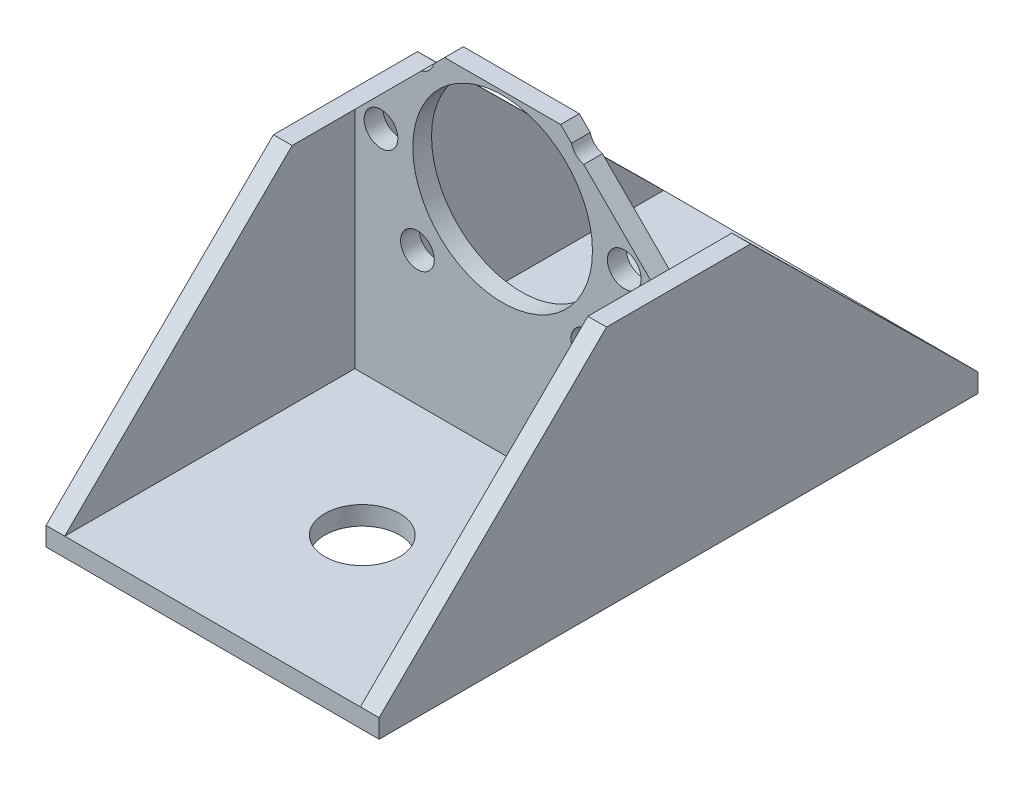
ISO-10303-21;
HEADER;
FILE_DESCRIPTION(('STEP AP214'),'2;1');
FILE_NAME('part.step','',(''),(''),'','','');
FILE_SCHEMA(('AUTOMOTIVE_DESIGN { 1 0 10303 214 1 1 1 1 }'));
ENDSEC;
DATA;
#1=APPLICATION_CONTEXT('core data for automotive mechanical design processes');
#2=APPLICATION_PROTOCOL_DEFINITION('international standard','automotive_design',2000,#1);
#3=PRODUCT_CONTEXT('',#1,'mechanical');
#4=PRODUCT('Part','Part','',(#3));
#5=PRODUCT_RELATED_PRODUCT_CATEGORY('part','',(#4));
#6=PRODUCT_DEFINITION_FORMATION('','',#4);
#7=PRODUCT_DEFINITION_CONTEXT('part definition',#1,'design');
#8=PRODUCT_DEFINITION('design','',#6,#7);
#9=PRODUCT_DEFINITION_SHAPE('','',#8);
#10=(LENGTH_UNIT() NAMED_UNIT(*) SI_UNIT(.MILLI.,.METRE.));
#11=(NAMED_UNIT(*) PLANE_ANGLE_UNIT() SI_UNIT($,.RADIAN.));
#12=(NAMED_UNIT(*) SI_UNIT($,.STERADIAN.) SOLID_ANGLE_UNIT());
#13=UNCERTAINTY_MEASURE_WITH_UNIT(LENGTH_MEASURE(1.E-05),#10,'distance_accuracy_value','');
#14=(GEOMETRIC_REPRESENTATION_CONTEXT(3) GLOBAL_UNCERTAINTY_ASSIGNED_CONTEXT((#13)) GLOBAL_UNIT_ASSIGNED_CONTEXT((#10,
#11,#12)) REPRESENTATION_CONTEXT('',''));
#15=CARTESIAN_POINT('',(0.,0.,0.));
#16=DIRECTION('',(0.,0.,1.));
#17=DIRECTION('',(1.,0.,0.));
#18=AXIS2_PLACEMENT_3D('',#15,#16,#17);
#19=CARTESIAN_POINT('',(14.9999999999999,15.,-1.25));
#20=DIRECTION('',(-0.707106781186544,-0.707106781186551,0.));
#21=DIRECTION('',(0.707106781186551,-0.707106781186544,0.));
#22=AXIS2_PLACEMENT_3D('',#19,#20,#21);
#23=PLANE('',#22);
#24=DIRECTION('',(0.707106781186551,-0.707106781186544,0.));
#25=VECTOR('',#24,1.);
#26=CARTESIAN_POINT('',(14.9999999999999,15.,-1.25));
#27=LINE('',#26,#25);
#28=CARTESIAN_POINT('',(10.8323559285244,19.1676440714755,-1.25));
#29=VERTEX_POINT('',#28);
#30=CARTESIAN_POINT('',(19.75,10.25,-1.25));
#31=VERTEX_POINT('',#30);
#32=EDGE_CURVE('E208',#29,#31,#27,.T.);
#33=ORIENTED_EDGE('',*,*,#32,.F.);
#34=DIRECTION('',(0.,0.,1.));
#35=VECTOR('',#34,1.);
#36=CARTESIAN_POINT('',(10.8323559285244,19.1676440714755,-7.61396103067893));
#37=LINE('',#36,#35);
#38=CARTESIAN_POINT('',(10.8323559285244,19.1676440714755,1.25));
#39=VERTEX_POINT('',#38);
#40=EDGE_CURVE('E337',#29,#39,#37,.T.);
#41=ORIENTED_EDGE('',*,*,#40,.T.);
#42=DIRECTION('',(0.707106781186551,-0.707106781186544,0.));
#43=VECTOR('',#42,1.);
#44=CARTESIAN_POINT('',(14.9999999999999,15.,1.25));
#45=LINE('',#44,#43);
#46=CARTESIAN_POINT('',(19.75,10.25,1.25));
#47=VERTEX_POINT('',#46);
#48=EDGE_CURVE('E339',#39,#47,#45,.T.);
#49=ORIENTED_EDGE('',*,*,#48,.T.);
#50=DIRECTION('',(0.,0.,1.));
#51=VECTOR('',#50,1.);
#52=CARTESIAN_POINT('',(19.75,10.25,-1.25));
#53=LINE('',#52,#51);
#54=EDGE_CURVE('E214',#31,#47,#53,.T.);
#55=ORIENTED_EDGE('',*,*,#54,.F.);
#56=EDGE_LOOP('',(#33,#41,#49,#55));
#57=FACE_BOUND('',#56,.T.);
#58=ADVANCED_FACE('F38',(#57),#23,.F.);
#59=CARTESIAN_POINT('',(-14.9999999999999,15.,-1.25));
#60=DIRECTION('',(-0.707106781186544,0.707106781186551,0.));
#61=DIRECTION('',(-0.707106781186551,-0.707106781186544,0.));
#62=AXIS2_PLACEMENT_3D('',#59,#60,#61);
#63=PLANE('',#62);
#64=DIRECTION('',(0.,0.,1.));
#65=VECTOR('',#64,1.);
#66=CARTESIAN_POINT('',(-10.8323559285243,19.1676440714756,-7.61396103067893));
#67=LINE('',#66,#65);
#68=CARTESIAN_POINT('',(-10.8323559285243,19.1676440714756,-1.25));
#69=VERTEX_POINT('',#68);
#70=CARTESIAN_POINT('',(-10.8323559285243,19.1676440714756,1.25));
#71=VERTEX_POINT('',#70);
#72=EDGE_CURVE('E61',#69,#71,#67,.T.);
#73=ORIENTED_EDGE('',*,*,#72,.F.);
#74=DIRECTION('',(-0.707106781186551,-0.707106781186544,0.));
#75=VECTOR('',#74,1.);
#76=CARTESIAN_POINT('',(-14.9999999999999,15.,-1.25));
#77=LINE('',#76,#75);
#78=CARTESIAN_POINT('',(-19.75,10.25,-1.25));
#79=VERTEX_POINT('',#78);
#80=EDGE_CURVE('E191',#69,#79,#77,.T.);
#81=ORIENTED_EDGE('',*,*,#80,.T.);
#82=DIRECTION('',(0.,0.,1.));
#83=VECTOR('',#82,1.);
#84=CARTESIAN_POINT('',(-19.75,10.25,-1.25));
#85=LINE('',#84,#83);
#86=CARTESIAN_POINT('',(-19.75,10.25,1.25));
#87=VERTEX_POINT('',#86);
#88=EDGE_CURVE('E217',#79,#87,#85,.T.);
#89=ORIENTED_EDGE('',*,*,#88,.T.);
#90=DIRECTION('',(-0.707106781186551,-0.707106781186544,0.));
#91=VECTOR('',#90,1.);
#92=CARTESIAN_POINT('',(-14.9999999999999,15.,1.25));
#93=LINE('',#92,#91);
#94=EDGE_CURVE('E390',#71,#87,#93,.T.);
#95=ORIENTED_EDGE('',*,*,#94,.F.);
#96=EDGE_LOOP('',(#73,#81,#89,#95));
#97=FACE_BOUND('',#96,.T.);
#98=ADVANCED_FACE('F401',(#97),#63,.T.);
#99=CARTESIAN_POINT('',(-19.75,-19.75,-40.));
#100=DIRECTION('',(-1.,0.,0.));
#101=DIRECTION('',(0.,0.,1.));
#102=AXIS2_PLACEMENT_3D('',#99,#100,#101);
#103=PLANE('',#102);
#104=DIRECTION('',(0.,1.,0.));
#105=VECTOR('',#104,1.);
#106=CARTESIAN_POINT('',(-19.75,0.,-1.25));
#107=LINE('',#106,#105);
#108=CARTESIAN_POINT('',(-19.75,-19.75,-1.25));
#109=VERTEX_POINT('',#108);
#110=EDGE_CURVE('E196',#109,#79,#107,.T.);
#111=ORIENTED_EDGE('',*,*,#110,.F.);
#112=DIRECTION('',(0.,0.,1.));
#113=VECTOR('',#112,1.);
#114=CARTESIAN_POINT('',(-19.75,-19.75,-40.));
#115=LINE('',#114,#113);
#116=CARTESIAN_POINT('',(-19.75,-19.75,-40.));
#117=VERTEX_POINT('',#116);
#118=EDGE_CURVE('E287',#117,#109,#115,.T.);
#119=ORIENTED_EDGE('',*,*,#118,.F.);
#120=DIRECTION('',(0.,0.702645672149301,0.711539921163849));
#121=VECTOR('',#120,1.);
#122=CARTESIAN_POINT('',(-19.75,-19.75,-40.));
#123=LINE('',#122,#121);
#124=CARTESIAN_POINT('',(-19.75,10.25,-9.62025316455697));
#125=VERTEX_POINT('',#124);
#126=EDGE_CURVE('E260',#117,#125,#123,.T.);
#127=ORIENTED_EDGE('',*,*,#126,.T.);
#128=DIRECTION('',(0.,0.,1.));
#129=VECTOR('',#128,1.);
#130=CARTESIAN_POINT('',(-19.75,10.25,-40.));
#131=LINE('',#130,#129);
#132=EDGE_CURVE('E264',#125,#79,#131,.T.);
#133=ORIENTED_EDGE('',*,*,#132,.T.);
#134=EDGE_LOOP('',(#111,#119,#127,#133));
#135=FACE_BOUND('',#134,.T.);
#136=ADVANCED_FACE('F406',(#135),#103,.F.);
#137=CARTESIAN_POINT('',(19.75,-19.75,-40.));
#138=DIRECTION('',(1.,0.,0.));
#139=DIRECTION('',(0.,1.,0.));
#140=AXIS2_PLACEMENT_3D('',#137,#138,#139);
#141=PLANE('',#140);
#142=DIRECTION('',(0.,-1.,0.));
#143=VECTOR('',#142,1.);
#144=CARTESIAN_POINT('',(19.75,0.,-1.25));
#145=LINE('',#144,#143);
#146=CARTESIAN_POINT('',(19.75,-19.75,-1.25));
#147=VERTEX_POINT('',#146);
#148=EDGE_CURVE('E205',#31,#147,#145,.T.);
#149=ORIENTED_EDGE('',*,*,#148,.F.);
#150=DIRECTION('',(0.,0.,-1.));
#151=VECTOR('',#150,1.);
#152=CARTESIAN_POINT('',(19.75,10.25,-40.));
#153=LINE('',#152,#151);
#154=CARTESIAN_POINT('',(19.75,10.25,-9.62025316455697));
#155=VERTEX_POINT('',#154);
#156=EDGE_CURVE('E46',#31,#155,#153,.T.);
#157=ORIENTED_EDGE('',*,*,#156,.T.);
#158=DIRECTION('',(0.,-0.702645672149301,-0.711539921163849));
#159=VECTOR('',#158,1.);
#160=CARTESIAN_POINT('',(19.75,-19.75,-40.));
#161=LINE('',#160,#159);
#162=CARTESIAN_POINT('',(19.75,-19.75,-40.));
#163=VERTEX_POINT('',#162);
#164=EDGE_CURVE('E257',#155,#163,#161,.T.);
#165=ORIENTED_EDGE('',*,*,#164,.T.);
#166=DIRECTION('',(0.,0.,1.));
#167=VECTOR('',#166,1.);
#168=CARTESIAN_POINT('',(19.75,-19.75,-40.));
#169=LINE('',#168,#167);
#170=EDGE_CURVE('E282',#163,#147,#169,.T.);
#171=ORIENTED_EDGE('',*,*,#170,.T.);
#172=EDGE_LOOP('',(#149,#157,#165,#171));
#173=FACE_BOUND('',#172,.T.);
#174=ADVANCED_FACE('F309',(#173),#141,.F.);
#175=CARTESIAN_POINT('',(-19.75,-19.75,-40.));
#176=DIRECTION('',(0.,-1.,0.));
#177=DIRECTION('',(0.,0.,-1.));
#178=AXIS2_PLACEMENT_3D('',#175,#176,#177);
#179=PLANE('',#178);
#180=CARTESIAN_POINT('',(0.,-19.75,-20.));
#181=DIRECTION('',(0.,-1.,0.));
#182=DIRECTION('',(0.,0.,-1.));
#183=AXIS2_PLACEMENT_3D('',#180,#181,#182);
#184=CIRCLE('',#183,5.);
#185=CARTESIAN_POINT('',(0.,-19.75,-25.));
#186=VERTEX_POINT('',#185);
#187=EDGE_CURVE('E381',#186,#186,#184,.F.);
#188=ORIENTED_EDGE('',*,*,#187,.F.);
#189=EDGE_LOOP('',(#188));
#190=FACE_BOUND('',#189,.T.);
#191=DIRECTION('',(1.,0.,0.));
#192=VECTOR('',#191,1.);
#193=CARTESIAN_POINT('',(0.,-19.75,-1.25));
#194=LINE('',#193,#192);
#195=EDGE_CURVE('E198',#109,#147,#194,.T.);
#196=ORIENTED_EDGE('',*,*,#195,.T.);
#197=ORIENTED_EDGE('',*,*,#170,.F.);
#198=DIRECTION('',(1.,0.,0.));
#199=VECTOR('',#198,1.);
#200=CARTESIAN_POINT('',(-19.75,-19.75,-40.));
#201=LINE('',#200,#199);
#202=EDGE_CURVE('E278',#117,#163,#201,.T.);
#203=ORIENTED_EDGE('',*,*,#202,.F.);
#204=ORIENTED_EDGE('',*,*,#118,.T.);
#205=EDGE_LOOP('',(#196,#197,#203,#204));
#206=FACE_BOUND('',#205,.T.);
#207=ADVANCED_FACE('F330',(#190,#206),#179,.F.);
#208=CARTESIAN_POINT('',(0.,0.,40.));
#209=DIRECTION('',(0.,0.,-1.));
#210=DIRECTION('',(-1.,0.,0.));
#211=AXIS2_PLACEMENT_3D('',#208,#209,#210);
#212=PLANE('',#211);
#213=DIRECTION('',(1.,0.,0.));
#214=VECTOR('',#213,1.);
#215=CARTESIAN_POINT('',(-112.604855984612,-19.75,40.));
#216=LINE('',#215,#214);
#217=CARTESIAN_POINT('',(-22.25,-19.75,40.));
#218=VERTEX_POINT('',#217);
#219=CARTESIAN_POINT('',(-19.75,-19.75,40.));
#220=VERTEX_POINT('',#219);
#221=EDGE_CURVE('E242',#218,#220,#216,.T.);
#222=ORIENTED_EDGE('',*,*,#221,.F.);
#223=DIRECTION('',(0.,-1.,0.));
#224=VECTOR('',#223,1.);
#225=CARTESIAN_POINT('',(-22.25,-22.25,40.));
#226=LINE('',#225,#224);
#227=CARTESIAN_POINT('',(-22.25,-22.25,40.));
#228=VERTEX_POINT('',#227);
#229=EDGE_CURVE('E273',#218,#228,#226,.T.);
#230=ORIENTED_EDGE('',*,*,#229,.T.);
#231=DIRECTION('',(1.,0.,0.));
#232=VECTOR('',#231,1.);
#233=CARTESIAN_POINT('',(-22.25,-22.25,40.));
#234=LINE('',#233,#232);
#235=CARTESIAN_POINT('',(22.25,-22.25,40.));
#236=VERTEX_POINT('',#235);
#237=EDGE_CURVE('E275',#228,#236,#234,.T.);
#238=ORIENTED_EDGE('',*,*,#237,.T.);
#239=DIRECTION('',(0.,1.,0.));
#240=VECTOR('',#239,1.);
#241=CARTESIAN_POINT('',(22.25,-22.25,40.));
#242=LINE('',#241,#240);
#243=CARTESIAN_POINT('',(22.25,-19.75,40.));
#244=VERTEX_POINT('',#243);
#245=EDGE_CURVE('E270',#236,#244,#242,.T.);
#246=ORIENTED_EDGE('',*,*,#245,.T.);
#247=DIRECTION('',(1.,0.,0.));
#248=VECTOR('',#247,1.);
#249=CARTESIAN_POINT('',(0.,-19.75,40.));
#250=LINE('',#249,#248);
#251=CARTESIAN_POINT('',(19.75,-19.75,40.));
#252=VERTEX_POINT('',#251);
#253=EDGE_CURVE('E300',#252,#244,#250,.T.);
#254=ORIENTED_EDGE('',*,*,#253,.F.);
#255=DIRECTION('',(1.,0.,0.));
#256=VECTOR('',#255,1.);
#257=CARTESIAN_POINT('',(-19.75,-19.75,40.));
#258=LINE('',#257,#256);
#259=EDGE_CURVE('E267',#220,#252,#258,.T.);
#260=ORIENTED_EDGE('',*,*,#259,.F.);
#261=EDGE_LOOP('',(#222,#230,#238,#246,#254,#260));
#262=FACE_BOUND('',#261,.T.);
#263=ADVANCED_FACE('F419',(#262),#212,.F.);
#264=CARTESIAN_POINT('',(22.25,-22.25,-40.));
#265=DIRECTION('',(1.,0.,0.));
#266=DIRECTION('',(0.,0.,-1.));
#267=AXIS2_PLACEMENT_3D('',#264,#265,#266);
#268=PLANE('',#267);
#269=DIRECTION('',(0.,-0.702645672149301,-0.711539921163849));
#270=VECTOR('',#269,1.);
#271=CARTESIAN_POINT('',(22.25,9.99920892334467,-9.87421881180287));
#272=LINE('',#271,#270);
#273=CARTESIAN_POINT('',(22.25,10.25,-9.62025316455697));
#274=VERTEX_POINT('',#273);
#275=CARTESIAN_POINT('',(22.25,-19.75,-40.));
#276=VERTEX_POINT('',#275);
#277=EDGE_CURVE('E226',#274,#276,#272,.T.);
#278=ORIENTED_EDGE('',*,*,#277,.F.);
#279=DIRECTION('',(0.,0.,-1.));
#280=VECTOR('',#279,1.);
#281=CARTESIAN_POINT('',(22.25,10.25,0.));
#282=LINE('',#281,#280);
#283=CARTESIAN_POINT('',(22.25,10.25,9.62025316455697));
#284=VERTEX_POINT('',#283);
#285=EDGE_CURVE('E229',#284,#274,#282,.T.);
#286=ORIENTED_EDGE('',*,*,#285,.F.);
#287=DIRECTION('',(0.,-0.702645672149301,0.711539921163849));
#288=VECTOR('',#287,1.);
#289=CARTESIAN_POINT('',(22.25,9.99920892334467,9.87421881180287));
#290=LINE('',#289,#288);
#291=EDGE_CURVE('E221',#284,#244,#290,.T.);
#292=ORIENTED_EDGE('',*,*,#291,.T.);
#293=ORIENTED_EDGE('',*,*,#245,.F.);
#294=DIRECTION('',(0.,0.,1.));
#295=VECTOR('',#294,1.);
#296=CARTESIAN_POINT('',(22.25,-22.25,-40.));
#297=LINE('',#296,#295);
#298=CARTESIAN_POINT('',(22.25,-22.25,-40.));
#299=VERTEX_POINT('',#298);
#300=EDGE_CURVE('E298',#299,#236,#297,.T.);
#301=ORIENTED_EDGE('',*,*,#300,.F.);
#302=DIRECTION('',(0.,1.,0.));
#303=VECTOR('',#302,1.);
#304=CARTESIAN_POINT('',(22.25,-22.25,-40.));
#305=LINE('',#304,#303);
#306=EDGE_CURVE('E285',#299,#276,#305,.T.);
#307=ORIENTED_EDGE('',*,*,#306,.T.);
#308=EDGE_LOOP('',(#278,#286,#292,#293,#301,#307));
#309=FACE_BOUND('',#308,.T.);
#310=ADVANCED_FACE('F40',(#309),#268,.T.);
#311=CARTESIAN_POINT('',(-22.25,-22.25,-40.));
#312=DIRECTION('',(0.,-1.,0.));
#313=DIRECTION('',(0.,0.,-1.));
#314=AXIS2_PLACEMENT_3D('',#311,#312,#313);
#315=PLANE('',#314);
#316=CARTESIAN_POINT('',(0.,-22.25,-20.));
#317=DIRECTION('',(0.,-1.,0.));
#318=DIRECTION('',(0.,0.,-1.));
#319=AXIS2_PLACEMENT_3D('',#316,#317,#318);
#320=CIRCLE('',#319,5.);
#321=CARTESIAN_POINT('',(0.,-22.25,-25.));
#322=VERTEX_POINT('',#321);
#323=EDGE_CURVE('E378',#322,#322,#320,.T.);
#324=ORIENTED_EDGE('',*,*,#323,.F.);
#325=EDGE_LOOP('',(#324));
#326=FACE_BOUND('',#325,.T.);
#327=CARTESIAN_POINT('',(0.,-22.25,20.));
#328=DIRECTION('',(0.,-1.,0.));
#329=DIRECTION('',(0.,0.,-1.));
#330=AXIS2_PLACEMENT_3D('',#327,#328,#329);
#331=CIRCLE('',#330,5.);
#332=CARTESIAN_POINT('',(0.,-22.25,15.));
#333=VERTEX_POINT('',#332);
#334=EDGE_CURVE('E377',#333,#333,#331,.T.);
#335=ORIENTED_EDGE('',*,*,#334,.F.);
#336=EDGE_LOOP('',(#335));
#337=FACE_BOUND('',#336,.T.);
#338=ORIENTED_EDGE('',*,*,#300,.T.);
#339=ORIENTED_EDGE('',*,*,#237,.F.);
#340=DIRECTION('',(0.,0.,1.));
#341=VECTOR('',#340,1.);
#342=CARTESIAN_POINT('',(-22.25,-22.25,-40.));
#343=LINE('',#342,#341);
#344=CARTESIAN_POINT('',(-22.25,-22.25,-40.));
#345=VERTEX_POINT('',#344);
#346=EDGE_CURVE('E297',#345,#228,#343,.T.);
#347=ORIENTED_EDGE('',*,*,#346,.F.);
#348=DIRECTION('',(1.,0.,0.));
#349=VECTOR('',#348,1.);
#350=CARTESIAN_POINT('',(-22.25,-22.25,-40.));
#351=LINE('',#350,#349);
#352=EDGE_CURVE('E294',#345,#299,#351,.T.);
#353=ORIENTED_EDGE('',*,*,#352,.T.);
#354=EDGE_LOOP('',(#338,#339,#347,#353));
#355=FACE_BOUND('',#354,.T.);
#356=ADVANCED_FACE('F427',(#326,#337,#355),#315,.T.);
#357=CARTESIAN_POINT('',(-22.25,-22.25,-40.));
#358=DIRECTION('',(-1.,0.,0.));
#359=DIRECTION('',(0.,0.,1.));
#360=AXIS2_PLACEMENT_3D('',#357,#358,#359);
#361=PLANE('',#360);
#362=DIRECTION('',(0.,-0.702645672149301,-0.711539921163849));
#363=VECTOR('',#362,1.);
#364=CARTESIAN_POINT('',(-22.25,9.99920892334467,-9.87421881180287));
#365=LINE('',#364,#363);
#366=CARTESIAN_POINT('',(-22.25,10.25,-9.62025316455697));
#367=VERTEX_POINT('',#366);
#368=CARTESIAN_POINT('',(-22.25,-19.75,-40.));
#369=VERTEX_POINT('',#368);
#370=EDGE_CURVE('E228',#367,#369,#365,.T.);
#371=ORIENTED_EDGE('',*,*,#370,.T.);
#372=DIRECTION('',(0.,-1.,0.));
#373=VECTOR('',#372,1.);
#374=CARTESIAN_POINT('',(-22.25,-22.25,-40.));
#375=LINE('',#374,#373);
#376=EDGE_CURVE('E292',#369,#345,#375,.T.);
#377=ORIENTED_EDGE('',*,*,#376,.T.);
#378=ORIENTED_EDGE('',*,*,#346,.T.);
#379=ORIENTED_EDGE('',*,*,#229,.F.);
#380=DIRECTION('',(0.,-0.702645672149301,0.711539921163849));
#381=VECTOR('',#380,1.);
#382=CARTESIAN_POINT('',(-22.25,9.99920892334467,9.87421881180287));
#383=LINE('',#382,#381);
#384=CARTESIAN_POINT('',(-22.25,10.25,9.62025316455697));
#385=VERTEX_POINT('',#384);
#386=EDGE_CURVE('E213',#385,#218,#383,.T.);
#387=ORIENTED_EDGE('',*,*,#386,.F.);
#388=DIRECTION('',(0.,0.,-1.));
#389=VECTOR('',#388,1.);
#390=CARTESIAN_POINT('',(-22.25,10.25,0.));
#391=LINE('',#390,#389);
#392=EDGE_CURVE('E224',#385,#367,#391,.T.);
#393=ORIENTED_EDGE('',*,*,#392,.T.);
#394=EDGE_LOOP('',(#371,#377,#378,#379,#387,#393));
#395=FACE_BOUND('',#394,.T.);
#396=ADVANCED_FACE('F412',(#395),#361,.T.);
#397=CARTESIAN_POINT('',(0.,0.,-40.));
#398=DIRECTION('',(0.,0.,-1.));
#399=DIRECTION('',(-1.,0.,0.));
#400=AXIS2_PLACEMENT_3D('',#397,#398,#399);
#401=PLANE('',#400);
#402=DIRECTION('',(1.,0.,0.));
#403=VECTOR('',#402,1.);
#404=CARTESIAN_POINT('',(-112.604855984612,-19.75,-40.));
#405=LINE('',#404,#403);
#406=EDGE_CURVE('E234',#163,#276,#405,.T.);
#407=ORIENTED_EDGE('',*,*,#406,.T.);
#408=ORIENTED_EDGE('',*,*,#306,.F.);
#409=ORIENTED_EDGE('',*,*,#352,.F.);
#410=ORIENTED_EDGE('',*,*,#376,.F.);
#411=EDGE_CURVE('E245',#369,#117,#405,.T.);
#412=ORIENTED_EDGE('',*,*,#411,.T.);
#413=ORIENTED_EDGE('',*,*,#202,.T.);
#414=EDGE_LOOP('',(#407,#408,#409,#410,#412,#413));
#415=FACE_BOUND('',#414,.T.);
#416=ADVANCED_FACE('F324',(#415),#401,.T.);
#417=CARTESIAN_POINT('',(-19.75,-19.75,1.25));
#418=VERTEX_POINT('',#417);
#419=EDGE_CURVE('E281',#418,#220,#115,.T.);
#420=ORIENTED_EDGE('',*,*,#419,.F.);
#421=DIRECTION('',(0.,1.,0.));
#422=VECTOR('',#421,1.);
#423=CARTESIAN_POINT('',(-19.75,0.,1.25));
#424=LINE('',#423,#422);
#425=EDGE_CURVE('E354',#418,#87,#424,.T.);
#426=ORIENTED_EDGE('',*,*,#425,.T.);
#427=CARTESIAN_POINT('',(-19.75,10.25,9.62025316455697));
#428=VERTEX_POINT('',#427);
#429=EDGE_CURVE('E263',#87,#428,#131,.T.);
#430=ORIENTED_EDGE('',*,*,#429,.T.);
#431=DIRECTION('',(0.,0.702645672149301,-0.711539921163849));
#432=VECTOR('',#431,1.);
#433=CARTESIAN_POINT('',(-19.75,20.2468356933787,-0.503124752788547));
#434=LINE('',#433,#432);
#435=EDGE_CURVE('E254',#220,#428,#434,.T.);
#436=ORIENTED_EDGE('',*,*,#435,.F.);
#437=EDGE_LOOP('',(#420,#426,#430,#436));
#438=FACE_BOUND('',#437,.T.);
#439=ADVANCED_FACE('F395',(#438),#103,.F.);
#440=CARTESIAN_POINT('',(19.75,10.25,9.62025316455697));
#441=VERTEX_POINT('',#440);
#442=EDGE_CURVE('E11',#441,#47,#153,.T.);
#443=ORIENTED_EDGE('',*,*,#442,.T.);
#444=DIRECTION('',(0.,-1.,0.));
#445=VECTOR('',#444,1.);
#446=CARTESIAN_POINT('',(19.75,0.,1.25));
#447=LINE('',#446,#445);
#448=CARTESIAN_POINT('',(19.75,-19.75,1.25));
#449=VERTEX_POINT('',#448);
#450=EDGE_CURVE('E344',#47,#449,#447,.T.);
#451=ORIENTED_EDGE('',*,*,#450,.T.);
#452=EDGE_CURVE('E286',#449,#252,#169,.T.);
#453=ORIENTED_EDGE('',*,*,#452,.T.);
#454=DIRECTION('',(0.,-0.702645672149301,0.711539921163849));
#455=VECTOR('',#454,1.);
#456=CARTESIAN_POINT('',(19.75,20.2468356933787,-0.503124752788547));
#457=LINE('',#456,#455);
#458=EDGE_CURVE('E251',#441,#252,#457,.T.);
#459=ORIENTED_EDGE('',*,*,#458,.F.);
#460=EDGE_LOOP('',(#443,#451,#453,#459));
#461=FACE_BOUND('',#460,.T.);
#462=ADVANCED_FACE('F343',(#461),#141,.F.);
#463=CARTESIAN_POINT('',(0.,-19.75,20.));
#464=DIRECTION('',(0.,-1.,0.));
#465=DIRECTION('',(0.,0.,-1.));
#466=AXIS2_PLACEMENT_3D('',#463,#464,#465);
#467=CIRCLE('',#466,5.);
#468=CARTESIAN_POINT('',(0.,-19.75,15.));
#469=VERTEX_POINT('',#468);
#470=EDGE_CURVE('E382',#469,#469,#467,.F.);
#471=ORIENTED_EDGE('',*,*,#470,.F.);
#472=EDGE_LOOP('',(#471));
#473=FACE_BOUND('',#472,.T.);
#474=ORIENTED_EDGE('',*,*,#452,.F.);
#475=DIRECTION('',(1.,0.,0.));
#476=VECTOR('',#475,1.);
#477=CARTESIAN_POINT('',(0.,-19.75,1.25));
#478=LINE('',#477,#476);
#479=EDGE_CURVE('E351',#418,#449,#478,.T.);
#480=ORIENTED_EDGE('',*,*,#479,.F.);
#481=ORIENTED_EDGE('',*,*,#419,.T.);
#482=ORIENTED_EDGE('',*,*,#259,.T.);
#483=EDGE_LOOP('',(#474,#480,#481,#482));
#484=FACE_BOUND('',#483,.T.);
#485=ADVANCED_FACE('F421',(#473,#484),#179,.F.);
#486=CARTESIAN_POINT('',(-112.604855984612,9.99920892334467,9.87421881180287));
#487=DIRECTION('',(0.,0.711539921163849,0.702645672149301));
#488=DIRECTION('',(0.,-0.702645672149301,0.711539921163849));
#489=AXIS2_PLACEMENT_3D('',#486,#487,#488);
#490=PLANE('',#489);
#491=ORIENTED_EDGE('',*,*,#458,.T.);
#492=ORIENTED_EDGE('',*,*,#253,.T.);
#493=ORIENTED_EDGE('',*,*,#291,.F.);
#494=DIRECTION('',(1.,0.,0.));
#495=VECTOR('',#494,1.);
#496=CARTESIAN_POINT('',(-112.604855984612,10.25,9.62025316455697));
#497=LINE('',#496,#495);
#498=EDGE_CURVE('E241',#441,#284,#497,.T.);
#499=ORIENTED_EDGE('',*,*,#498,.F.);
#500=EDGE_LOOP('',(#491,#492,#493,#499));
#501=FACE_BOUND('',#500,.T.);
#502=ADVANCED_FACE('F422',(#501),#490,.T.);
#503=CARTESIAN_POINT('',(-112.604855984612,10.25,0.));
#504=DIRECTION('',(0.,-1.,0.));
#505=DIRECTION('',(0.,0.,-1.));
#506=AXIS2_PLACEMENT_3D('',#503,#504,#505);
#507=PLANE('',#506);
#508=ORIENTED_EDGE('',*,*,#498,.T.);
#509=ORIENTED_EDGE('',*,*,#285,.T.);
#510=DIRECTION('',(1.,0.,0.));
#511=VECTOR('',#510,1.);
#512=CARTESIAN_POINT('',(-112.604855984612,10.25,-9.62025316455697));
#513=LINE('',#512,#511);
#514=EDGE_CURVE('E237',#155,#274,#513,.T.);
#515=ORIENTED_EDGE('',*,*,#514,.F.);
#516=ORIENTED_EDGE('',*,*,#156,.F.);
#517=ORIENTED_EDGE('',*,*,#54,.T.);
#518=ORIENTED_EDGE('',*,*,#442,.F.);
#519=EDGE_LOOP('',(#508,#509,#515,#516,#517,#518));
#520=FACE_BOUND('',#519,.T.);
#521=ADVANCED_FACE('F317',(#520),#507,.F.);
#522=CARTESIAN_POINT('',(-112.604855984612,9.99920892334467,-9.87421881180287));
#523=DIRECTION('',(0.,-0.711539921163849,0.702645672149301));
#524=DIRECTION('',(0.,-0.702645672149301,-0.711539921163849));
#525=AXIS2_PLACEMENT_3D('',#522,#523,#524);
#526=PLANE('',#525);
#527=ORIENTED_EDGE('',*,*,#514,.T.);
#528=ORIENTED_EDGE('',*,*,#277,.T.);
#529=ORIENTED_EDGE('',*,*,#406,.F.);
#530=ORIENTED_EDGE('',*,*,#164,.F.);
#531=EDGE_LOOP('',(#527,#528,#529,#530));
#532=FACE_BOUND('',#531,.T.);
#533=ADVANCED_FACE('F315',(#532),#526,.F.);
#534=EDGE_CURVE('E248',#367,#125,#513,.T.);
#535=ORIENTED_EDGE('',*,*,#534,.F.);
#536=ORIENTED_EDGE('',*,*,#392,.F.);
#537=EDGE_CURVE('E225',#385,#428,#497,.T.);
#538=ORIENTED_EDGE('',*,*,#537,.T.);
#539=ORIENTED_EDGE('',*,*,#429,.F.);
#540=ORIENTED_EDGE('',*,*,#88,.F.);
#541=ORIENTED_EDGE('',*,*,#132,.F.);
#542=EDGE_LOOP('',(#535,#536,#538,#539,#540,#541));
#543=FACE_BOUND('',#542,.T.);
#544=ADVANCED_FACE('F404',(#543),#507,.F.);
#545=ORIENTED_EDGE('',*,*,#411,.F.);
#546=ORIENTED_EDGE('',*,*,#370,.F.);
#547=ORIENTED_EDGE('',*,*,#534,.T.);
#548=ORIENTED_EDGE('',*,*,#126,.F.);
#549=EDGE_LOOP('',(#545,#546,#547,#548));
#550=FACE_BOUND('',#549,.T.);
#551=ADVANCED_FACE('F408',(#550),#526,.F.);
#552=ORIENTED_EDGE('',*,*,#435,.T.);
#553=ORIENTED_EDGE('',*,*,#537,.F.);
#554=ORIENTED_EDGE('',*,*,#386,.T.);
#555=ORIENTED_EDGE('',*,*,#221,.T.);
#556=EDGE_LOOP('',(#552,#553,#554,#555));
#557=FACE_BOUND('',#556,.T.);
#558=ADVANCED_FACE('F416',(#557),#490,.T.);
#559=CARTESIAN_POINT('',(0.,22.25,-1.25));
#560=DIRECTION('',(0.,-1.,0.));
#561=DIRECTION('',(0.,0.,-1.));
#562=AXIS2_PLACEMENT_3D('',#559,#560,#561);
#563=PLANE('',#562);
#564=DIRECTION('',(0.,0.,1.));
#565=VECTOR('',#564,1.);
#566=CARTESIAN_POINT('',(-7.74999999999986,22.25,-1.25));
#567=LINE('',#566,#565);
#568=CARTESIAN_POINT('',(-7.74999999999986,22.25,-1.25));
#569=VERTEX_POINT('',#568);
#570=CARTESIAN_POINT('',(-7.74999999999986,22.25,1.25));
#571=VERTEX_POINT('',#570);
#572=EDGE_CURVE('E194',#569,#571,#567,.T.);
#573=ORIENTED_EDGE('',*,*,#572,.T.);
#574=DIRECTION('',(1.,0.,0.));
#575=VECTOR('',#574,1.);
#576=CARTESIAN_POINT('',(0.,22.25,1.25));
#577=LINE('',#576,#575);
#578=CARTESIAN_POINT('',(7.74999999999986,22.25,1.25));
#579=VERTEX_POINT('',#578);
#580=EDGE_CURVE('E365',#571,#579,#577,.T.);
#581=ORIENTED_EDGE('',*,*,#580,.T.);
#582=DIRECTION('',(0.,0.,1.));
#583=VECTOR('',#582,1.);
#584=CARTESIAN_POINT('',(7.74999999999986,22.25,-1.25));
#585=LINE('',#584,#583);
#586=CARTESIAN_POINT('',(7.74999999999986,22.25,-1.25));
#587=VERTEX_POINT('',#586);
#588=EDGE_CURVE('E211',#587,#579,#585,.T.);
#589=ORIENTED_EDGE('',*,*,#588,.F.);
#590=DIRECTION('',(1.,0.,0.));
#591=VECTOR('',#590,1.);
#592=CARTESIAN_POINT('',(0.,22.25,-1.25));
#593=LINE('',#592,#591);
#594=EDGE_CURVE('E200',#569,#587,#593,.T.);
#595=ORIENTED_EDGE('',*,*,#594,.F.);
#596=EDGE_LOOP('',(#573,#581,#589,#595));
#597=FACE_BOUND('',#596,.T.);
#598=ADVANCED_FACE('F363',(#597),#563,.F.);
#599=CARTESIAN_POINT('',(9.19756059137974,20.8024394086201,1.25));
#600=VERTEX_POINT('',#599);
#601=EDGE_CURVE('E353',#579,#600,#45,.T.);
#602=ORIENTED_EDGE('',*,*,#601,.T.);
#603=DIRECTION('',(0.,0.,1.));
#604=VECTOR('',#603,1.);
#605=CARTESIAN_POINT('',(9.19756059137975,20.8024394086201,-7.61396103067893));
#606=LINE('',#605,#604);
#607=CARTESIAN_POINT('',(9.19756059137975,20.8024394086201,-1.25));
#608=VERTEX_POINT('',#607);
#609=EDGE_CURVE('E53',#600,#608,#606,.F.);
#610=ORIENTED_EDGE('',*,*,#609,.T.);
#611=EDGE_CURVE('E209',#587,#608,#27,.T.);
#612=ORIENTED_EDGE('',*,*,#611,.F.);
#613=ORIENTED_EDGE('',*,*,#588,.T.);
#614=EDGE_LOOP('',(#602,#610,#612,#613));
#615=FACE_BOUND('',#614,.T.);
#616=ADVANCED_FACE('F366',(#615),#23,.F.);
#617=DIRECTION('',(0.,0.,1.));
#618=VECTOR('',#617,1.);
#619=CARTESIAN_POINT('',(-9.19756059138012,20.8024394086198,-7.61396103067893));
#620=LINE('',#619,#618);
#621=CARTESIAN_POINT('',(-9.19756059138012,20.8024394086198,1.25));
#622=VERTEX_POINT('',#621);
#623=CARTESIAN_POINT('',(-9.19756059138012,20.8024394086198,-1.25));
#624=VERTEX_POINT('',#623);
#625=EDGE_CURVE('E173',#622,#624,#620,.F.);
#626=ORIENTED_EDGE('',*,*,#625,.F.);
#627=EDGE_CURVE('E391',#571,#622,#93,.T.);
#628=ORIENTED_EDGE('',*,*,#627,.F.);
#629=ORIENTED_EDGE('',*,*,#572,.F.);
#630=EDGE_CURVE('E189',#569,#624,#77,.T.);
#631=ORIENTED_EDGE('',*,*,#630,.T.);
#632=EDGE_LOOP('',(#626,#628,#629,#631));
#633=FACE_BOUND('',#632,.T.);
#634=ADVANCED_FACE('F193',(#633),#63,.T.);
#635=CARTESIAN_POINT('',(0.,0.,-1.25));
#636=DIRECTION('',(0.,0.,1.));
#637=DIRECTION('',(1.,0.,0.));
#638=AXIS2_PLACEMENT_3D('',#635,#636,#637);
#639=PLANE('',#638);
#640=CARTESIAN_POINT('',(-11.3799165199048,-1.84999999999964,-1.25));
#641=DIRECTION('',(0.,0.,1.));
#642=DIRECTION('',(1.,0.,0.));
#643=AXIS2_PLACEMENT_3D('',#640,#641,#642);
#644=CIRCLE('',#643,2.25);
#645=CARTESIAN_POINT('',(-9.12991651990483,-1.84999999999964,-1.25));
#646=VERTEX_POINT('',#645);
#647=EDGE_CURVE('E718',#646,#646,#644,.F.);
#648=ORIENTED_EDGE('',*,*,#647,.F.);
#649=EDGE_LOOP('',(#648));
#650=FACE_BOUND('',#649,.T.);
#651=CARTESIAN_POINT('',(16.2499999999998,9.75000000000034,-1.25));
#652=DIRECTION('',(0.,0.,1.));
#653=DIRECTION('',(1.,0.,0.));
#654=AXIS2_PLACEMENT_3D('',#651,#652,#653);
#655=CIRCLE('',#654,2.25);
#656=CARTESIAN_POINT('',(18.4999999999998,9.75000000000034,-1.25));
#657=VERTEX_POINT('',#656);
#658=EDGE_CURVE('E730',#657,#657,#655,.F.);
#659=ORIENTED_EDGE('',*,*,#658,.F.);
#660=EDGE_LOOP('',(#659));
#661=FACE_BOUND('',#660,.T.);
#662=CARTESIAN_POINT('',(-16.25,9.75000000000034,-1.25));
#663=DIRECTION('',(0.,0.,1.));
#664=DIRECTION('',(1.,0.,0.));
#665=AXIS2_PLACEMENT_3D('',#662,#663,#664);
#666=CIRCLE('',#665,2.25);
#667=CARTESIAN_POINT('',(-14.,9.75000000000034,-1.25));
#668=VERTEX_POINT('',#667);
#669=EDGE_CURVE('E735',#668,#668,#666,.F.);
#670=ORIENTED_EDGE('',*,*,#669,.F.);
#671=EDGE_LOOP('',(#670));
#672=FACE_BOUND('',#671,.T.);
#673=CARTESIAN_POINT('',(11.3799165199046,-1.84999999999963,-1.25));
#674=DIRECTION('',(0.,0.,1.));
#675=DIRECTION('',(1.,0.,0.));
#676=AXIS2_PLACEMENT_3D('',#673,#674,#675);
#677=CIRCLE('',#676,2.25);
#678=CARTESIAN_POINT('',(13.6299165199046,-1.84999999999963,-1.25));
#679=VERTEX_POINT('',#678);
#680=EDGE_CURVE('E722',#679,#679,#677,.F.);
#681=ORIENTED_EDGE('',*,*,#680,.F.);
#682=EDGE_LOOP('',(#681));
#683=FACE_BOUND('',#682,.T.);
#684=CARTESIAN_POINT('',(-1.67671865974883E-13,9.75000000000035,-1.25));
#685=DIRECTION('',(0.,0.,1.));
#686=DIRECTION('',(1.,0.,0.));
#687=AXIS2_PLACEMENT_3D('',#684,#685,#686);
#688=CIRCLE('',#687,12.);
#689=CARTESIAN_POINT('',(11.9999999999998,9.75000000000035,-1.25));
#690=VERTEX_POINT('',#689);
#691=EDGE_CURVE('E374',#690,#690,#688,.F.);
#692=ORIENTED_EDGE('',*,*,#691,.F.);
#693=EDGE_LOOP('',(#692));
#694=FACE_BOUND('',#693,.T.);
#695=ORIENTED_EDGE('',*,*,#611,.T.);
#696=CARTESIAN_POINT('',(11.3799165199046,21.3500000000003,-1.25));
#697=DIRECTION('',(0.,0.,1.));
#698=DIRECTION('',(1.,0.,0.));
#699=AXIS2_PLACEMENT_3D('',#696,#697,#698);
#700=CIRCLE('',#699,2.25);
#701=EDGE_CURVE('E334',#29,#608,#700,.F.);
#702=ORIENTED_EDGE('',*,*,#701,.F.);
#703=ORIENTED_EDGE('',*,*,#32,.T.);
#704=ORIENTED_EDGE('',*,*,#148,.T.);
#705=ORIENTED_EDGE('',*,*,#195,.F.);
#706=ORIENTED_EDGE('',*,*,#110,.T.);
#707=ORIENTED_EDGE('',*,*,#80,.F.);
#708=CARTESIAN_POINT('',(-11.3799165199048,21.3500000000003,-1.25));
#709=DIRECTION('',(0.,0.,1.));
#710=DIRECTION('',(1.,0.,0.));
#711=AXIS2_PLACEMENT_3D('',#708,#709,#710);
#712=CIRCLE('',#711,2.25);
#713=EDGE_CURVE('E176',#624,#69,#712,.F.);
#714=ORIENTED_EDGE('',*,*,#713,.F.);
#715=ORIENTED_EDGE('',*,*,#630,.F.);
#716=ORIENTED_EDGE('',*,*,#594,.T.);
#717=EDGE_LOOP('',(#695,#702,#703,#704,#705,#706,#707,#714,#715,#716));
#718=FACE_BOUND('',#717,.T.);
#719=ADVANCED_FACE('F187',(#650,#661,#672,#683,#694,#718),#639,.F.);
#720=CARTESIAN_POINT('',(0.,0.,1.25));
#721=DIRECTION('',(0.,0.,1.));
#722=DIRECTION('',(1.,0.,0.));
#723=AXIS2_PLACEMENT_3D('',#720,#721,#722);
#724=PLANE('',#723);
#725=CARTESIAN_POINT('',(-11.3799165199048,-1.84999999999964,1.25));
#726=DIRECTION('',(0.,0.,1.));
#727=DIRECTION('',(-1.,0.,0.));
#728=AXIS2_PLACEMENT_3D('',#725,#726,#727);
#729=CIRCLE('',#728,2.25);
#730=CARTESIAN_POINT('',(-13.6299165199048,-1.84999999999964,1.25));
#731=VERTEX_POINT('',#730);
#732=EDGE_CURVE('E721',#731,#731,#729,.T.);
#733=ORIENTED_EDGE('',*,*,#732,.F.);
#734=EDGE_LOOP('',(#733));
#735=FACE_BOUND('',#734,.T.);
#736=CARTESIAN_POINT('',(16.2499999999998,9.75000000000034,1.25));
#737=DIRECTION('',(0.,0.,1.));
#738=DIRECTION('',(1.,0.,0.));
#739=AXIS2_PLACEMENT_3D('',#736,#737,#738);
#740=CIRCLE('',#739,2.25);
#741=CARTESIAN_POINT('',(18.4999999999998,9.75000000000034,1.25));
#742=VERTEX_POINT('',#741);
#743=EDGE_CURVE('E724',#742,#742,#740,.T.);
#744=ORIENTED_EDGE('',*,*,#743,.F.);
#745=EDGE_LOOP('',(#744));
#746=FACE_BOUND('',#745,.T.);
#747=CARTESIAN_POINT('',(-16.25,9.75000000000034,1.25));
#748=DIRECTION('',(0.,0.,1.));
#749=DIRECTION('',(1.,0.,0.));
#750=AXIS2_PLACEMENT_3D('',#747,#748,#749);
#751=CIRCLE('',#750,2.25);
#752=CARTESIAN_POINT('',(-14.,9.75000000000034,1.25));
#753=VERTEX_POINT('',#752);
#754=EDGE_CURVE('E737',#753,#753,#751,.T.);
#755=ORIENTED_EDGE('',*,*,#754,.F.);
#756=EDGE_LOOP('',(#755));
#757=FACE_BOUND('',#756,.T.);
#758=CARTESIAN_POINT('',(11.3799165199046,21.3500000000003,1.25));
#759=DIRECTION('',(0.,0.,1.));
#760=DIRECTION('',(1.,0.,0.));
#761=AXIS2_PLACEMENT_3D('',#758,#759,#760);
#762=CIRCLE('',#761,2.25);
#763=EDGE_CURVE('E733',#600,#39,#762,.T.);
#764=ORIENTED_EDGE('',*,*,#763,.F.);
#765=ORIENTED_EDGE('',*,*,#601,.F.);
#766=ORIENTED_EDGE('',*,*,#580,.F.);
#767=ORIENTED_EDGE('',*,*,#627,.T.);
#768=CARTESIAN_POINT('',(-11.3799165199048,21.3500000000003,1.25));
#769=DIRECTION('',(0.,0.,1.));
#770=DIRECTION('',(1.,0.,0.));
#771=AXIS2_PLACEMENT_3D('',#768,#769,#770);
#772=CIRCLE('',#771,2.25);
#773=EDGE_CURVE('E177',#71,#622,#772,.T.);
#774=ORIENTED_EDGE('',*,*,#773,.F.);
#775=ORIENTED_EDGE('',*,*,#94,.T.);
#776=ORIENTED_EDGE('',*,*,#425,.F.);
#777=ORIENTED_EDGE('',*,*,#479,.T.);
#778=ORIENTED_EDGE('',*,*,#450,.F.);
#779=ORIENTED_EDGE('',*,*,#48,.F.);
#780=EDGE_LOOP('',(#764,#765,#766,#767,#774,#775,#776,#777,#778,#779));
#781=FACE_BOUND('',#780,.T.);
#782=CARTESIAN_POINT('',(11.3799165199046,-1.84999999999963,1.25));
#783=DIRECTION('',(0.,0.,1.));
#784=DIRECTION('',(-1.,0.,0.));
#785=AXIS2_PLACEMENT_3D('',#782,#783,#784);
#786=CIRCLE('',#785,2.25);
#787=CARTESIAN_POINT('',(9.12991651990456,-1.84999999999963,1.25));
#788=VERTEX_POINT('',#787);
#789=EDGE_CURVE('E727',#788,#788,#786,.T.);
#790=ORIENTED_EDGE('',*,*,#789,.F.);
#791=EDGE_LOOP('',(#790));
#792=FACE_BOUND('',#791,.T.);
#793=CARTESIAN_POINT('',(-1.67671865974883E-13,9.75000000000035,1.25));
#794=DIRECTION('',(0.,0.,1.));
#795=DIRECTION('',(1.,0.,0.));
#796=AXIS2_PLACEMENT_3D('',#793,#794,#795);
#797=CIRCLE('',#796,12.);
#798=CARTESIAN_POINT('',(11.9999999999998,9.75000000000035,1.25));
#799=VERTEX_POINT('',#798);
#800=EDGE_CURVE('E368',#799,#799,#797,.T.);
#801=ORIENTED_EDGE('',*,*,#800,.F.);
#802=EDGE_LOOP('',(#801));
#803=FACE_BOUND('',#802,.T.);
#804=ADVANCED_FACE('F348',(#735,#746,#757,#781,#792,#803),#724,.T.);
#805=CARTESIAN_POINT('',(0.,-5.60786437626904,20.));
#806=DIRECTION('',(0.,-1.,0.));
#807=DIRECTION('',(0.,0.,-1.));
#808=AXIS2_PLACEMENT_3D('',#805,#806,#807);
#809=CYLINDRICAL_SURFACE('',#808,5.);
#810=ORIENTED_EDGE('',*,*,#470,.T.);
#811=EDGE_LOOP('',(#810));
#812=FACE_BOUND('',#811,.T.);
#813=ORIENTED_EDGE('',*,*,#334,.T.);
#814=EDGE_LOOP('',(#813));
#815=FACE_BOUND('',#814,.T.);
#816=ADVANCED_FACE('F610',(#812,#815),#809,.F.);
#817=CARTESIAN_POINT('',(0.,-5.60786437626904,-20.));
#818=DIRECTION('',(0.,-1.,0.));
#819=DIRECTION('',(0.,0.,-1.));
#820=AXIS2_PLACEMENT_3D('',#817,#818,#819);
#821=CYLINDRICAL_SURFACE('',#820,5.);
#822=ORIENTED_EDGE('',*,*,#187,.T.);
#823=EDGE_LOOP('',(#822));
#824=FACE_BOUND('',#823,.T.);
#825=ORIENTED_EDGE('',*,*,#323,.T.);
#826=EDGE_LOOP('',(#825));
#827=FACE_BOUND('',#826,.T.);
#828=ADVANCED_FACE('F625',(#824,#827),#821,.F.);
#829=CARTESIAN_POINT('',(-1.67671865974883E-13,9.75000000000035,-35.1911254969543));
#830=DIRECTION('',(0.,0.,1.));
#831=DIRECTION('',(1.,0.,0.));
#832=AXIS2_PLACEMENT_3D('',#829,#830,#831);
#833=CYLINDRICAL_SURFACE('',#832,12.);
#834=ORIENTED_EDGE('',*,*,#691,.T.);
#835=EDGE_LOOP('',(#834));
#836=FACE_BOUND('',#835,.T.);
#837=ORIENTED_EDGE('',*,*,#800,.T.);
#838=EDGE_LOOP('',(#837));
#839=FACE_BOUND('',#838,.T.);
#840=ADVANCED_FACE('F634',(#836,#839),#833,.F.);
#841=CARTESIAN_POINT('',(-11.3799165199048,21.3500000000003,-7.61396103067893));
#842=DIRECTION('',(0.,0.,1.));
#843=DIRECTION('',(1.,0.,0.));
#844=AXIS2_PLACEMENT_3D('',#841,#842,#843);
#845=CYLINDRICAL_SURFACE('',#844,2.25);
#846=ORIENTED_EDGE('',*,*,#72,.T.);
#847=ORIENTED_EDGE('',*,*,#773,.T.);
#848=ORIENTED_EDGE('',*,*,#625,.T.);
#849=ORIENTED_EDGE('',*,*,#713,.T.);
#850=EDGE_LOOP('',(#846,#847,#848,#849));
#851=FACE_BOUND('',#850,.T.);
#852=ADVANCED_FACE('F175',(#851),#845,.F.);
#853=CARTESIAN_POINT('',(11.3799165199046,-1.84999999999963,-7.61396103067893));
#854=DIRECTION('',(0.,0.,1.));
#855=DIRECTION('',(1.,0.,0.));
#856=AXIS2_PLACEMENT_3D('',#853,#854,#855);
#857=CYLINDRICAL_SURFACE('',#856,2.25);
#858=ORIENTED_EDGE('',*,*,#680,.T.);
#859=EDGE_LOOP('',(#858));
#860=FACE_BOUND('',#859,.T.);
#861=ORIENTED_EDGE('',*,*,#789,.T.);
#862=EDGE_LOOP('',(#861));
#863=FACE_BOUND('',#862,.T.);
#864=ADVANCED_FACE('F658',(#860,#863),#857,.F.);
#865=CARTESIAN_POINT('',(11.3799165199046,21.3500000000003,-7.61396103067893));
#866=DIRECTION('',(0.,0.,1.));
#867=DIRECTION('',(1.,0.,0.));
#868=AXIS2_PLACEMENT_3D('',#865,#866,#867);
#869=CYLINDRICAL_SURFACE('',#868,2.25);
#870=ORIENTED_EDGE('',*,*,#701,.T.);
#871=ORIENTED_EDGE('',*,*,#609,.F.);
#872=ORIENTED_EDGE('',*,*,#763,.T.);
#873=ORIENTED_EDGE('',*,*,#40,.F.);
#874=EDGE_LOOP('',(#870,#871,#872,#873));
#875=FACE_BOUND('',#874,.T.);
#876=ADVANCED_FACE('F666',(#875),#869,.F.);
#877=CARTESIAN_POINT('',(-16.25,9.75000000000034,-7.61396103067893));
#878=DIRECTION('',(0.,0.,1.));
#879=DIRECTION('',(1.,0.,0.));
#880=AXIS2_PLACEMENT_3D('',#877,#878,#879);
#881=CYLINDRICAL_SURFACE('',#880,2.25);
#882=ORIENTED_EDGE('',*,*,#669,.T.);
#883=EDGE_LOOP('',(#882));
#884=FACE_BOUND('',#883,.T.);
#885=ORIENTED_EDGE('',*,*,#754,.T.);
#886=EDGE_LOOP('',(#885));
#887=FACE_BOUND('',#886,.T.);
#888=ADVANCED_FACE('F675',(#884,#887),#881,.F.);
#889=CARTESIAN_POINT('',(16.2499999999998,9.75000000000034,-7.61396103067893));
#890=DIRECTION('',(0.,0.,1.));
#891=DIRECTION('',(1.,0.,0.));
#892=AXIS2_PLACEMENT_3D('',#889,#890,#891);
#893=CYLINDRICAL_SURFACE('',#892,2.25);
#894=ORIENTED_EDGE('',*,*,#658,.T.);
#895=EDGE_LOOP('',(#894));
#896=FACE_BOUND('',#895,.T.);
#897=ORIENTED_EDGE('',*,*,#743,.T.);
#898=EDGE_LOOP('',(#897));
#899=FACE_BOUND('',#898,.T.);
#900=ADVANCED_FACE('F683',(#896,#899),#893,.F.);
#901=CARTESIAN_POINT('',(-11.3799165199048,-1.84999999999964,-7.61396103067893));
#902=DIRECTION('',(0.,0.,1.));
#903=DIRECTION('',(1.,0.,0.));
#904=AXIS2_PLACEMENT_3D('',#901,#902,#903);
#905=CYLINDRICAL_SURFACE('',#904,2.25);
#906=ORIENTED_EDGE('',*,*,#647,.T.);
#907=EDGE_LOOP('',(#906));
#908=FACE_BOUND('',#907,.T.);
#909=ORIENTED_EDGE('',*,*,#732,.T.);
#910=EDGE_LOOP('',(#909));
#911=FACE_BOUND('',#910,.T.);
#912=ADVANCED_FACE('F692',(#908,#911),#905,.F.);
#913=CLOSED_SHELL('',(#58,#98,#136,#174,#207,#263,#310,#356,#396,#416,#439,#462,#485,#502,#521,
#533,#544,#551,#558,#598,#616,#634,#719,#804,#816,#828,#840,#852,#864,#876,#888,#900,#912));
#914=MANIFOLD_SOLID_BREP('B2',#913);
#915=ADVANCED_BREP_SHAPE_REPRESENTATION('',(#18,#914),#14);
#916=SHAPE_DEFINITION_REPRESENTATION(#9,#915);
ENDSEC;
END-ISO-10303-21;
